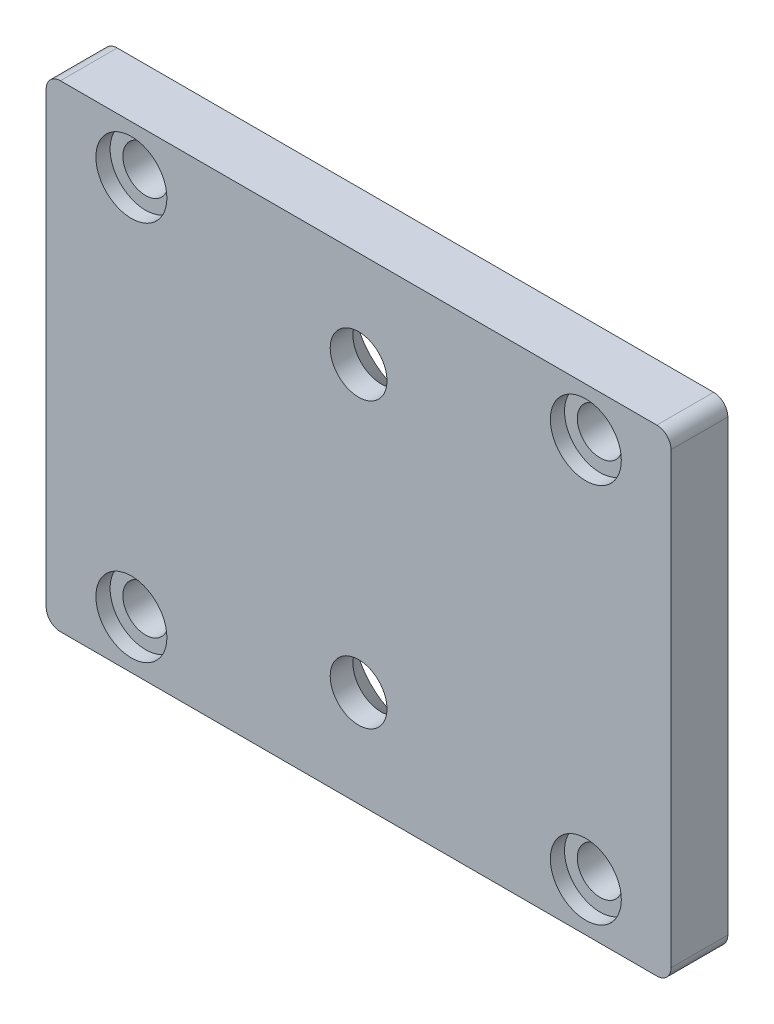
ISO-10303-21;
HEADER;
FILE_DESCRIPTION(('STEP AP214'),'2;1');
FILE_NAME('part.step','',(''),(''),'','','');
FILE_SCHEMA(('AUTOMOTIVE_DESIGN { 1 0 10303 214 1 1 1 1 }'));
ENDSEC;
DATA;
#1=APPLICATION_CONTEXT('core data for automotive mechanical design processes');
#2=APPLICATION_PROTOCOL_DEFINITION('international standard','automotive_design',2000,#1);
#3=PRODUCT_CONTEXT('',#1,'mechanical');
#4=PRODUCT('Part','Part','',(#3));
#5=PRODUCT_RELATED_PRODUCT_CATEGORY('part','',(#4));
#6=PRODUCT_DEFINITION_FORMATION('','',#4);
#7=PRODUCT_DEFINITION_CONTEXT('part definition',#1,'design');
#8=PRODUCT_DEFINITION('design','',#6,#7);
#9=PRODUCT_DEFINITION_SHAPE('','',#8);
#10=(LENGTH_UNIT() NAMED_UNIT(*) SI_UNIT(.MILLI.,.METRE.));
#11=(NAMED_UNIT(*) PLANE_ANGLE_UNIT() SI_UNIT($,.RADIAN.));
#12=(NAMED_UNIT(*) SI_UNIT($,.STERADIAN.) SOLID_ANGLE_UNIT());
#13=UNCERTAINTY_MEASURE_WITH_UNIT(LENGTH_MEASURE(1.E-05),#10,'distance_accuracy_value','');
#14=(GEOMETRIC_REPRESENTATION_CONTEXT(3) GLOBAL_UNCERTAINTY_ASSIGNED_CONTEXT((#13)) GLOBAL_UNIT_ASSIGNED_CONTEXT((#10,
#11,#12)) REPRESENTATION_CONTEXT('',''));
#15=CARTESIAN_POINT('',(0.,0.,0.));
#16=DIRECTION('',(0.,0.,1.));
#17=DIRECTION('',(1.,0.,0.));
#18=AXIS2_PLACEMENT_3D('',#15,#16,#17);
#19=CARTESIAN_POINT('',(11.,3.4,-2.));
#20=DIRECTION('',(0.,0.,-1.));
#21=DIRECTION('',(-1.,0.,0.));
#22=AXIS2_PLACEMENT_3D('',#19,#20,#21);
#23=CONICAL_SURFACE('',#22,2.2,0.785398163397449);
#24=CARTESIAN_POINT('',(11.,3.4,-2.));
#25=DIRECTION('',(0.,0.,-1.));
#26=DIRECTION('',(-1.,0.,0.));
#27=AXIS2_PLACEMENT_3D('',#24,#25,#26);
#28=CIRCLE('',#27,2.2);
#29=CARTESIAN_POINT('',(8.8,3.4,-2.));
#30=VERTEX_POINT('',#29);
#31=EDGE_CURVE('E11',#30,#30,#28,.T.);
#32=ORIENTED_EDGE('',*,*,#31,.T.);
#33=EDGE_LOOP('',(#32));
#34=FACE_BOUND('',#33,.T.);
#35=CARTESIAN_POINT('',(11.,3.4,-0.8));
#36=DIRECTION('',(0.,0.,-1.));
#37=DIRECTION('',(-1.,0.,0.));
#38=AXIS2_PLACEMENT_3D('',#35,#36,#37);
#39=CIRCLE('',#38,0.999999999999999);
#40=CARTESIAN_POINT('',(10.,3.4,-0.8));
#41=VERTEX_POINT('',#40);
#42=EDGE_CURVE('E26',#41,#41,#39,.T.);
#43=ORIENTED_EDGE('',*,*,#42,.F.);
#44=EDGE_LOOP('',(#43));
#45=FACE_BOUND('',#44,.T.);
#46=ADVANCED_FACE('F16',(#34,#45),#23,.F.);
#47=CARTESIAN_POINT('',(11.,3.4,-2.));
#48=DIRECTION('',(0.,0.,-1.));
#49=DIRECTION('',(-1.,0.,0.));
#50=AXIS2_PLACEMENT_3D('',#47,#48,#49);
#51=CYLINDRICAL_SURFACE('',#50,0.999999999999999);
#52=ORIENTED_EDGE('',*,*,#42,.T.);
#53=EDGE_LOOP('',(#52));
#54=FACE_BOUND('',#53,.T.);
#55=CARTESIAN_POINT('',(11.,3.4,0.));
#56=DIRECTION('',(0.,0.,-1.));
#57=DIRECTION('',(-1.,0.,0.));
#58=AXIS2_PLACEMENT_3D('',#55,#56,#57);
#59=CIRCLE('',#58,0.999999999999999);
#60=CARTESIAN_POINT('',(10.,3.4,0.));
#61=VERTEX_POINT('',#60);
#62=EDGE_CURVE('E106',#61,#61,#59,.T.);
#63=ORIENTED_EDGE('',*,*,#62,.F.);
#64=EDGE_LOOP('',(#63));
#65=FACE_BOUND('',#64,.T.);
#66=ADVANCED_FACE('F224',(#54,#65),#51,.F.);
#67=CARTESIAN_POINT('',(11.,13.4,-2.));
#68=DIRECTION('',(0.,0.,-1.));
#69=DIRECTION('',(-1.,0.,0.));
#70=AXIS2_PLACEMENT_3D('',#67,#68,#69);
#71=CONICAL_SURFACE('',#70,2.2,0.785398163397449);
#72=CARTESIAN_POINT('',(11.,13.4,-2.));
#73=DIRECTION('',(0.,0.,-1.));
#74=DIRECTION('',(-1.,0.,0.));
#75=AXIS2_PLACEMENT_3D('',#72,#73,#74);
#76=CIRCLE('',#75,2.2);
#77=CARTESIAN_POINT('',(8.8,13.4,-2.));
#78=VERTEX_POINT('',#77);
#79=EDGE_CURVE('E216',#78,#78,#76,.T.);
#80=ORIENTED_EDGE('',*,*,#79,.T.);
#81=EDGE_LOOP('',(#80));
#82=FACE_BOUND('',#81,.T.);
#83=CARTESIAN_POINT('',(11.,13.4,-0.8));
#84=DIRECTION('',(0.,0.,-1.));
#85=DIRECTION('',(-1.,0.,0.));
#86=AXIS2_PLACEMENT_3D('',#83,#84,#85);
#87=CIRCLE('',#86,0.999999999999999);
#88=CARTESIAN_POINT('',(10.,13.4,-0.8));
#89=VERTEX_POINT('',#88);
#90=EDGE_CURVE('E211',#89,#89,#87,.T.);
#91=ORIENTED_EDGE('',*,*,#90,.F.);
#92=EDGE_LOOP('',(#91));
#93=FACE_BOUND('',#92,.T.);
#94=ADVANCED_FACE('F234',(#82,#93),#71,.F.);
#95=CARTESIAN_POINT('',(11.,13.4,-2.));
#96=DIRECTION('',(0.,0.,-1.));
#97=DIRECTION('',(-1.,0.,0.));
#98=AXIS2_PLACEMENT_3D('',#95,#96,#97);
#99=CYLINDRICAL_SURFACE('',#98,0.999999999999999);
#100=ORIENTED_EDGE('',*,*,#90,.T.);
#101=EDGE_LOOP('',(#100));
#102=FACE_BOUND('',#101,.T.);
#103=CARTESIAN_POINT('',(11.,13.4,0.));
#104=DIRECTION('',(0.,0.,-1.));
#105=DIRECTION('',(-1.,0.,0.));
#106=AXIS2_PLACEMENT_3D('',#103,#104,#105);
#107=CIRCLE('',#106,0.999999999999999);
#108=CARTESIAN_POINT('',(10.,13.4,0.));
#109=VERTEX_POINT('',#108);
#110=EDGE_CURVE('E111',#109,#109,#107,.T.);
#111=ORIENTED_EDGE('',*,*,#110,.F.);
#112=EDGE_LOOP('',(#111));
#113=FACE_BOUND('',#112,.T.);
#114=ADVANCED_FACE('F239',(#102,#113),#99,.F.);
#115=CARTESIAN_POINT('',(3.,15.1,0.));
#116=DIRECTION('',(0.,0.,1.));
#117=DIRECTION('',(1.,0.,0.));
#118=AXIS2_PLACEMENT_3D('',#115,#116,#117);
#119=CYLINDRICAL_SURFACE('',#118,1.25);
#120=CARTESIAN_POINT('',(3.,15.1,0.));
#121=DIRECTION('',(0.,0.,1.));
#122=DIRECTION('',(1.,0.,0.));
#123=AXIS2_PLACEMENT_3D('',#120,#121,#122);
#124=CIRCLE('',#123,1.25);
#125=CARTESIAN_POINT('',(4.25,15.1,0.));
#126=VERTEX_POINT('',#125);
#127=EDGE_CURVE('E206',#126,#126,#124,.T.);
#128=ORIENTED_EDGE('',*,*,#127,.T.);
#129=EDGE_LOOP('',(#128));
#130=FACE_BOUND('',#129,.T.);
#131=CARTESIAN_POINT('',(3.,15.1,-0.5));
#132=DIRECTION('',(0.,0.,1.));
#133=DIRECTION('',(1.,0.,0.));
#134=AXIS2_PLACEMENT_3D('',#131,#132,#133);
#135=CIRCLE('',#134,1.25);
#136=CARTESIAN_POINT('',(4.25,15.1,-0.5));
#137=VERTEX_POINT('',#136);
#138=EDGE_CURVE('E203',#137,#137,#135,.T.);
#139=ORIENTED_EDGE('',*,*,#138,.F.);
#140=EDGE_LOOP('',(#139));
#141=FACE_BOUND('',#140,.T.);
#142=ADVANCED_FACE('F243',(#130,#141),#119,.F.);
#143=CARTESIAN_POINT('',(3.,15.1,0.));
#144=DIRECTION('',(0.,0.,1.));
#145=DIRECTION('',(1.,0.,0.));
#146=AXIS2_PLACEMENT_3D('',#143,#144,#145);
#147=CYLINDRICAL_SURFACE('',#146,0.8);
#148=CARTESIAN_POINT('',(3.,15.1,-0.5));
#149=DIRECTION('',(0.,0.,1.));
#150=DIRECTION('',(1.,0.,0.));
#151=AXIS2_PLACEMENT_3D('',#148,#149,#150);
#152=CIRCLE('',#151,0.8);
#153=CARTESIAN_POINT('',(3.8,15.1,-0.5));
#154=VERTEX_POINT('',#153);
#155=EDGE_CURVE('E200',#154,#154,#152,.T.);
#156=ORIENTED_EDGE('',*,*,#155,.T.);
#157=EDGE_LOOP('',(#156));
#158=FACE_BOUND('',#157,.T.);
#159=CARTESIAN_POINT('',(3.,15.1,-2.));
#160=DIRECTION('',(0.,0.,1.));
#161=DIRECTION('',(1.,0.,0.));
#162=AXIS2_PLACEMENT_3D('',#159,#160,#161);
#163=CIRCLE('',#162,0.8);
#164=CARTESIAN_POINT('',(3.8,15.1,-2.));
#165=VERTEX_POINT('',#164);
#166=EDGE_CURVE('E94',#165,#165,#163,.T.);
#167=ORIENTED_EDGE('',*,*,#166,.F.);
#168=EDGE_LOOP('',(#167));
#169=FACE_BOUND('',#168,.T.);
#170=ADVANCED_FACE('F247',(#158,#169),#147,.F.);
#171=CARTESIAN_POINT('',(19.,15.1,0.));
#172=DIRECTION('',(0.,0.,1.));
#173=DIRECTION('',(1.,0.,0.));
#174=AXIS2_PLACEMENT_3D('',#171,#172,#173);
#175=CYLINDRICAL_SURFACE('',#174,1.25);
#176=CARTESIAN_POINT('',(19.,15.1,0.));
#177=DIRECTION('',(0.,0.,1.));
#178=DIRECTION('',(1.,0.,0.));
#179=AXIS2_PLACEMENT_3D('',#176,#177,#178);
#180=CIRCLE('',#179,1.25);
#181=CARTESIAN_POINT('',(20.25,15.1,0.));
#182=VERTEX_POINT('',#181);
#183=EDGE_CURVE('E195',#182,#182,#180,.T.);
#184=ORIENTED_EDGE('',*,*,#183,.T.);
#185=EDGE_LOOP('',(#184));
#186=FACE_BOUND('',#185,.T.);
#187=CARTESIAN_POINT('',(19.,15.1,-0.5));
#188=DIRECTION('',(0.,0.,1.));
#189=DIRECTION('',(1.,0.,0.));
#190=AXIS2_PLACEMENT_3D('',#187,#188,#189);
#191=CIRCLE('',#190,1.25);
#192=CARTESIAN_POINT('',(20.25,15.1,-0.5));
#193=VERTEX_POINT('',#192);
#194=EDGE_CURVE('E192',#193,#193,#191,.T.);
#195=ORIENTED_EDGE('',*,*,#194,.F.);
#196=EDGE_LOOP('',(#195));
#197=FACE_BOUND('',#196,.T.);
#198=ADVANCED_FACE('F251',(#186,#197),#175,.F.);
#199=CARTESIAN_POINT('',(19.,15.1,0.));
#200=DIRECTION('',(0.,0.,1.));
#201=DIRECTION('',(1.,0.,0.));
#202=AXIS2_PLACEMENT_3D('',#199,#200,#201);
#203=CYLINDRICAL_SURFACE('',#202,0.799999999999999);
#204=CARTESIAN_POINT('',(19.,15.1,-0.5));
#205=DIRECTION('',(0.,0.,1.));
#206=DIRECTION('',(1.,0.,0.));
#207=AXIS2_PLACEMENT_3D('',#204,#205,#206);
#208=CIRCLE('',#207,0.800000000000002);
#209=CARTESIAN_POINT('',(19.8,15.1,-0.5));
#210=VERTEX_POINT('',#209);
#211=EDGE_CURVE('E189',#210,#210,#208,.T.);
#212=ORIENTED_EDGE('',*,*,#211,.T.);
#213=EDGE_LOOP('',(#212));
#214=FACE_BOUND('',#213,.T.);
#215=CARTESIAN_POINT('',(19.,15.1,-2.));
#216=DIRECTION('',(0.,0.,1.));
#217=DIRECTION('',(1.,0.,0.));
#218=AXIS2_PLACEMENT_3D('',#215,#216,#217);
#219=CIRCLE('',#218,0.799999999999999);
#220=CARTESIAN_POINT('',(19.8,15.1,-2.));
#221=VERTEX_POINT('',#220);
#222=EDGE_CURVE('E186',#221,#221,#219,.T.);
#223=ORIENTED_EDGE('',*,*,#222,.F.);
#224=EDGE_LOOP('',(#223));
#225=FACE_BOUND('',#224,.T.);
#226=ADVANCED_FACE('F255',(#214,#225),#203,.F.);
#227=CARTESIAN_POINT('',(19.,1.7,0.));
#228=DIRECTION('',(0.,0.,1.));
#229=DIRECTION('',(1.,0.,0.));
#230=AXIS2_PLACEMENT_3D('',#227,#228,#229);
#231=CYLINDRICAL_SURFACE('',#230,1.25);
#232=CARTESIAN_POINT('',(19.,1.7,0.));
#233=DIRECTION('',(0.,0.,1.));
#234=DIRECTION('',(1.,0.,0.));
#235=AXIS2_PLACEMENT_3D('',#232,#233,#234);
#236=CIRCLE('',#235,1.25);
#237=CARTESIAN_POINT('',(20.25,1.7,0.));
#238=VERTEX_POINT('',#237);
#239=EDGE_CURVE('E183',#238,#238,#236,.T.);
#240=ORIENTED_EDGE('',*,*,#239,.T.);
#241=EDGE_LOOP('',(#240));
#242=FACE_BOUND('',#241,.T.);
#243=CARTESIAN_POINT('',(19.,1.7,-0.5));
#244=DIRECTION('',(0.,0.,1.));
#245=DIRECTION('',(1.,0.,0.));
#246=AXIS2_PLACEMENT_3D('',#243,#244,#245);
#247=CIRCLE('',#246,1.25);
#248=CARTESIAN_POINT('',(20.25,1.7,-0.5));
#249=VERTEX_POINT('',#248);
#250=EDGE_CURVE('E180',#249,#249,#247,.T.);
#251=ORIENTED_EDGE('',*,*,#250,.F.);
#252=EDGE_LOOP('',(#251));
#253=FACE_BOUND('',#252,.T.);
#254=ADVANCED_FACE('F259',(#242,#253),#231,.F.);
#255=CARTESIAN_POINT('',(19.,1.7,0.));
#256=DIRECTION('',(0.,0.,1.));
#257=DIRECTION('',(1.,0.,0.));
#258=AXIS2_PLACEMENT_3D('',#255,#256,#257);
#259=CYLINDRICAL_SURFACE('',#258,0.799999999999999);
#260=CARTESIAN_POINT('',(19.,1.7,-0.5));
#261=DIRECTION('',(0.,0.,1.));
#262=DIRECTION('',(1.,0.,0.));
#263=AXIS2_PLACEMENT_3D('',#260,#261,#262);
#264=CIRCLE('',#263,0.800000000000002);
#265=CARTESIAN_POINT('',(19.8,1.7,-0.5));
#266=VERTEX_POINT('',#265);
#267=EDGE_CURVE('E177',#266,#266,#264,.T.);
#268=ORIENTED_EDGE('',*,*,#267,.T.);
#269=EDGE_LOOP('',(#268));
#270=FACE_BOUND('',#269,.T.);
#271=CARTESIAN_POINT('',(19.,1.7,-2.));
#272=DIRECTION('',(0.,0.,1.));
#273=DIRECTION('',(1.,0.,0.));
#274=AXIS2_PLACEMENT_3D('',#271,#272,#273);
#275=CIRCLE('',#274,0.799999999999999);
#276=CARTESIAN_POINT('',(19.8,1.7,-2.));
#277=VERTEX_POINT('',#276);
#278=EDGE_CURVE('E174',#277,#277,#275,.T.);
#279=ORIENTED_EDGE('',*,*,#278,.F.);
#280=EDGE_LOOP('',(#279));
#281=FACE_BOUND('',#280,.T.);
#282=ADVANCED_FACE('F263',(#270,#281),#259,.F.);
#283=CARTESIAN_POINT('',(3.,1.7,0.));
#284=DIRECTION('',(0.,0.,1.));
#285=DIRECTION('',(1.,0.,0.));
#286=AXIS2_PLACEMENT_3D('',#283,#284,#285);
#287=CYLINDRICAL_SURFACE('',#286,1.25);
#288=CARTESIAN_POINT('',(3.,1.7,0.));
#289=DIRECTION('',(0.,0.,1.));
#290=DIRECTION('',(1.,0.,0.));
#291=AXIS2_PLACEMENT_3D('',#288,#289,#290);
#292=CIRCLE('',#291,1.25);
#293=CARTESIAN_POINT('',(4.25,1.7,0.));
#294=VERTEX_POINT('',#293);
#295=EDGE_CURVE('E171',#294,#294,#292,.T.);
#296=ORIENTED_EDGE('',*,*,#295,.T.);
#297=EDGE_LOOP('',(#296));
#298=FACE_BOUND('',#297,.T.);
#299=CARTESIAN_POINT('',(3.,1.7,-0.5));
#300=DIRECTION('',(0.,0.,1.));
#301=DIRECTION('',(1.,0.,0.));
#302=AXIS2_PLACEMENT_3D('',#299,#300,#301);
#303=CIRCLE('',#302,1.25);
#304=CARTESIAN_POINT('',(4.25,1.7,-0.5));
#305=VERTEX_POINT('',#304);
#306=EDGE_CURVE('E130',#305,#305,#303,.T.);
#307=ORIENTED_EDGE('',*,*,#306,.F.);
#308=EDGE_LOOP('',(#307));
#309=FACE_BOUND('',#308,.T.);
#310=ADVANCED_FACE('F267',(#298,#309),#287,.F.);
#311=CARTESIAN_POINT('',(3.,1.7,0.));
#312=DIRECTION('',(0.,0.,1.));
#313=DIRECTION('',(1.,0.,0.));
#314=AXIS2_PLACEMENT_3D('',#311,#312,#313);
#315=CYLINDRICAL_SURFACE('',#314,0.8);
#316=CARTESIAN_POINT('',(3.,1.7,-0.5));
#317=DIRECTION('',(0.,0.,1.));
#318=DIRECTION('',(1.,0.,0.));
#319=AXIS2_PLACEMENT_3D('',#316,#317,#318);
#320=CIRCLE('',#319,0.8);
#321=CARTESIAN_POINT('',(3.8,1.7,-0.5));
#322=VERTEX_POINT('',#321);
#323=EDGE_CURVE('E168',#322,#322,#320,.T.);
#324=ORIENTED_EDGE('',*,*,#323,.T.);
#325=EDGE_LOOP('',(#324));
#326=FACE_BOUND('',#325,.T.);
#327=CARTESIAN_POINT('',(3.,1.7,-2.));
#328=DIRECTION('',(0.,0.,1.));
#329=DIRECTION('',(1.,0.,0.));
#330=AXIS2_PLACEMENT_3D('',#327,#328,#329);
#331=CIRCLE('',#330,0.8);
#332=CARTESIAN_POINT('',(3.8,1.7,-2.));
#333=VERTEX_POINT('',#332);
#334=EDGE_CURVE('E146',#333,#333,#331,.T.);
#335=ORIENTED_EDGE('',*,*,#334,.F.);
#336=EDGE_LOOP('',(#335));
#337=FACE_BOUND('',#336,.T.);
#338=ADVANCED_FACE('F271',(#326,#337),#315,.F.);
#339=CARTESIAN_POINT('',(0.,0.,-2.));
#340=DIRECTION('',(-1.,0.,0.));
#341=DIRECTION('',(0.,0.,1.));
#342=AXIS2_PLACEMENT_3D('',#339,#340,#341);
#343=PLANE('',#342);
#344=DIRECTION('',(0.,-1.,0.));
#345=VECTOR('',#344,1.);
#346=CARTESIAN_POINT('',(0.,0.,-2.));
#347=LINE('',#346,#345);
#348=CARTESIAN_POINT('',(0.,16.3,-2.));
#349=VERTEX_POINT('',#348);
#350=CARTESIAN_POINT('',(0.,0.5,-2.));
#351=VERTEX_POINT('',#350);
#352=EDGE_CURVE('E154',#349,#351,#347,.T.);
#353=ORIENTED_EDGE('',*,*,#352,.T.);
#354=DIRECTION('',(0.,0.,1.));
#355=VECTOR('',#354,1.);
#356=CARTESIAN_POINT('',(0.,0.5,-2.));
#357=LINE('',#356,#355);
#358=CARTESIAN_POINT('',(0.,0.5,0.));
#359=VERTEX_POINT('',#358);
#360=EDGE_CURVE('E35',#351,#359,#357,.T.);
#361=ORIENTED_EDGE('',*,*,#360,.T.);
#362=DIRECTION('',(0.,-1.,0.));
#363=VECTOR('',#362,1.);
#364=CARTESIAN_POINT('',(0.,0.,0.));
#365=LINE('',#364,#363);
#366=CARTESIAN_POINT('',(0.,16.3,0.));
#367=VERTEX_POINT('',#366);
#368=EDGE_CURVE('E118',#367,#359,#365,.T.);
#369=ORIENTED_EDGE('',*,*,#368,.F.);
#370=DIRECTION('',(0.,0.,-1.));
#371=VECTOR('',#370,1.);
#372=CARTESIAN_POINT('',(0.,16.3,-2.));
#373=LINE('',#372,#371);
#374=EDGE_CURVE('E160',#367,#349,#373,.T.);
#375=ORIENTED_EDGE('',*,*,#374,.T.);
#376=EDGE_LOOP('',(#353,#361,#369,#375));
#377=FACE_BOUND('',#376,.T.);
#378=ADVANCED_FACE('F162',(#377),#343,.T.);
#379=CARTESIAN_POINT('',(0.,16.8,-2.));
#380=DIRECTION('',(0.,1.,0.));
#381=DIRECTION('',(0.,0.,1.));
#382=AXIS2_PLACEMENT_3D('',#379,#380,#381);
#383=PLANE('',#382);
#384=DIRECTION('',(-1.,0.,0.));
#385=VECTOR('',#384,1.);
#386=CARTESIAN_POINT('',(0.,16.8,-2.));
#387=LINE('',#386,#385);
#388=CARTESIAN_POINT('',(21.5,16.8,-2.));
#389=VERTEX_POINT('',#388);
#390=CARTESIAN_POINT('',(0.5,16.8,-2.));
#391=VERTEX_POINT('',#390);
#392=EDGE_CURVE('E152',#389,#391,#387,.T.);
#393=ORIENTED_EDGE('',*,*,#392,.T.);
#394=DIRECTION('',(0.,0.,1.));
#395=VECTOR('',#394,1.);
#396=CARTESIAN_POINT('',(0.5,16.8,-2.));
#397=LINE('',#396,#395);
#398=CARTESIAN_POINT('',(0.5,16.8,0.));
#399=VERTEX_POINT('',#398);
#400=EDGE_CURVE('E133',#391,#399,#397,.T.);
#401=ORIENTED_EDGE('',*,*,#400,.T.);
#402=DIRECTION('',(-1.,0.,0.));
#403=VECTOR('',#402,1.);
#404=CARTESIAN_POINT('',(0.,16.8,0.));
#405=LINE('',#404,#403);
#406=CARTESIAN_POINT('',(21.5,16.8,0.));
#407=VERTEX_POINT('',#406);
#408=EDGE_CURVE('E123',#407,#399,#405,.T.);
#409=ORIENTED_EDGE('',*,*,#408,.F.);
#410=DIRECTION('',(0.,0.,-1.));
#411=VECTOR('',#410,1.);
#412=CARTESIAN_POINT('',(21.5,16.8,-2.));
#413=LINE('',#412,#411);
#414=EDGE_CURVE('E135',#407,#389,#413,.T.);
#415=ORIENTED_EDGE('',*,*,#414,.T.);
#416=EDGE_LOOP('',(#393,#401,#409,#415));
#417=FACE_BOUND('',#416,.T.);
#418=ADVANCED_FACE('F278',(#417),#383,.T.);
#419=CARTESIAN_POINT('',(22.,0.,-2.));
#420=DIRECTION('',(1.,0.,0.));
#421=DIRECTION('',(0.,0.,-1.));
#422=AXIS2_PLACEMENT_3D('',#419,#420,#421);
#423=PLANE('',#422);
#424=DIRECTION('',(0.,1.,0.));
#425=VECTOR('',#424,1.);
#426=CARTESIAN_POINT('',(22.,0.,0.));
#427=LINE('',#426,#425);
#428=CARTESIAN_POINT('',(22.,0.5,0.));
#429=VERTEX_POINT('',#428);
#430=CARTESIAN_POINT('',(22.,16.3,0.));
#431=VERTEX_POINT('',#430);
#432=EDGE_CURVE('E120',#429,#431,#427,.T.);
#433=ORIENTED_EDGE('',*,*,#432,.F.);
#434=DIRECTION('',(0.,0.,-1.));
#435=VECTOR('',#434,1.);
#436=CARTESIAN_POINT('',(22.,0.5,-2.));
#437=LINE('',#436,#435);
#438=CARTESIAN_POINT('',(22.,0.5,-2.));
#439=VERTEX_POINT('',#438);
#440=EDGE_CURVE('E136',#429,#439,#437,.T.);
#441=ORIENTED_EDGE('',*,*,#440,.T.);
#442=DIRECTION('',(0.,1.,0.));
#443=VECTOR('',#442,1.);
#444=CARTESIAN_POINT('',(22.,0.,-2.));
#445=LINE('',#444,#443);
#446=CARTESIAN_POINT('',(22.,16.3,-2.));
#447=VERTEX_POINT('',#446);
#448=EDGE_CURVE('E103',#439,#447,#445,.T.);
#449=ORIENTED_EDGE('',*,*,#448,.T.);
#450=DIRECTION('',(0.,0.,1.));
#451=VECTOR('',#450,1.);
#452=CARTESIAN_POINT('',(22.,16.3,-2.));
#453=LINE('',#452,#451);
#454=EDGE_CURVE('E140',#447,#431,#453,.T.);
#455=ORIENTED_EDGE('',*,*,#454,.T.);
#456=EDGE_LOOP('',(#433,#441,#449,#455));
#457=FACE_BOUND('',#456,.T.);
#458=ADVANCED_FACE('F281',(#457),#423,.T.);
#459=CARTESIAN_POINT('',(0.,0.,-2.));
#460=DIRECTION('',(0.,-1.,0.));
#461=DIRECTION('',(0.,0.,-1.));
#462=AXIS2_PLACEMENT_3D('',#459,#460,#461);
#463=PLANE('',#462);
#464=DIRECTION('',(1.,0.,0.));
#465=VECTOR('',#464,1.);
#466=CARTESIAN_POINT('',(0.,0.,0.));
#467=LINE('',#466,#465);
#468=CARTESIAN_POINT('',(0.5,0.,0.));
#469=VERTEX_POINT('',#468);
#470=CARTESIAN_POINT('',(21.5,0.,0.));
#471=VERTEX_POINT('',#470);
#472=EDGE_CURVE('E119',#469,#471,#467,.T.);
#473=ORIENTED_EDGE('',*,*,#472,.F.);
#474=DIRECTION('',(0.,0.,-1.));
#475=VECTOR('',#474,1.);
#476=CARTESIAN_POINT('',(0.5,0.,-2.));
#477=LINE('',#476,#475);
#478=CARTESIAN_POINT('',(0.5,0.,-2.));
#479=VERTEX_POINT('',#478);
#480=EDGE_CURVE('E98',#469,#479,#477,.T.);
#481=ORIENTED_EDGE('',*,*,#480,.T.);
#482=DIRECTION('',(1.,0.,0.));
#483=VECTOR('',#482,1.);
#484=CARTESIAN_POINT('',(0.,0.,-2.));
#485=LINE('',#484,#483);
#486=CARTESIAN_POINT('',(21.5,0.,-2.));
#487=VERTEX_POINT('',#486);
#488=EDGE_CURVE('E80',#479,#487,#485,.T.);
#489=ORIENTED_EDGE('',*,*,#488,.T.);
#490=DIRECTION('',(0.,0.,1.));
#491=VECTOR('',#490,1.);
#492=CARTESIAN_POINT('',(21.5,0.,-2.));
#493=LINE('',#492,#491);
#494=EDGE_CURVE('E87',#487,#471,#493,.T.);
#495=ORIENTED_EDGE('',*,*,#494,.T.);
#496=EDGE_LOOP('',(#473,#481,#489,#495));
#497=FACE_BOUND('',#496,.T.);
#498=ADVANCED_FACE('F96',(#497),#463,.T.);
#499=CARTESIAN_POINT('',(0.,0.,-2.));
#500=DIRECTION('',(0.,0.,-1.));
#501=DIRECTION('',(-1.,0.,0.));
#502=AXIS2_PLACEMENT_3D('',#499,#500,#501);
#503=PLANE('',#502);
#504=ORIENTED_EDGE('',*,*,#31,.F.);
#505=EDGE_LOOP('',(#504));
#506=FACE_BOUND('',#505,.T.);
#507=ORIENTED_EDGE('',*,*,#79,.F.);
#508=EDGE_LOOP('',(#507));
#509=FACE_BOUND('',#508,.T.);
#510=ORIENTED_EDGE('',*,*,#166,.T.);
#511=EDGE_LOOP('',(#510));
#512=FACE_BOUND('',#511,.T.);
#513=ORIENTED_EDGE('',*,*,#222,.T.);
#514=EDGE_LOOP('',(#513));
#515=FACE_BOUND('',#514,.T.);
#516=ORIENTED_EDGE('',*,*,#278,.T.);
#517=EDGE_LOOP('',(#516));
#518=FACE_BOUND('',#517,.T.);
#519=ORIENTED_EDGE('',*,*,#334,.T.);
#520=EDGE_LOOP('',(#519));
#521=FACE_BOUND('',#520,.T.);
#522=ORIENTED_EDGE('',*,*,#488,.F.);
#523=CARTESIAN_POINT('',(0.5,0.5,-2.));
#524=DIRECTION('',(0.,0.,-1.));
#525=DIRECTION('',(-1.,0.,0.));
#526=AXIS2_PLACEMENT_3D('',#523,#524,#525);
#527=CIRCLE('',#526,0.5);
#528=EDGE_CURVE('E145',#479,#351,#527,.T.);
#529=ORIENTED_EDGE('',*,*,#528,.T.);
#530=ORIENTED_EDGE('',*,*,#352,.F.);
#531=CARTESIAN_POINT('',(0.5,16.3,-2.));
#532=DIRECTION('',(0.,0.,-1.));
#533=DIRECTION('',(-1.,0.,0.));
#534=AXIS2_PLACEMENT_3D('',#531,#532,#533);
#535=CIRCLE('',#534,0.5);
#536=EDGE_CURVE('E108',#349,#391,#535,.T.);
#537=ORIENTED_EDGE('',*,*,#536,.T.);
#538=ORIENTED_EDGE('',*,*,#392,.F.);
#539=CARTESIAN_POINT('',(21.5,16.3,-2.));
#540=DIRECTION('',(0.,0.,-1.));
#541=DIRECTION('',(-1.,0.,0.));
#542=AXIS2_PLACEMENT_3D('',#539,#540,#541);
#543=CIRCLE('',#542,0.5);
#544=EDGE_CURVE('E105',#389,#447,#543,.T.);
#545=ORIENTED_EDGE('',*,*,#544,.T.);
#546=ORIENTED_EDGE('',*,*,#448,.F.);
#547=CARTESIAN_POINT('',(21.5,0.5,-2.));
#548=DIRECTION('',(0.,0.,-1.));
#549=DIRECTION('',(-1.,0.,0.));
#550=AXIS2_PLACEMENT_3D('',#547,#548,#549);
#551=CIRCLE('',#550,0.5);
#552=EDGE_CURVE('E90',#439,#487,#551,.T.);
#553=ORIENTED_EDGE('',*,*,#552,.T.);
#554=EDGE_LOOP('',(#522,#529,#530,#537,#538,#545,#546,#553));
#555=FACE_BOUND('',#554,.T.);
#556=ADVANCED_FACE('F100',(#506,#509,#512,#515,#518,#521,#555),#503,.T.);
#557=CARTESIAN_POINT('',(0.,0.,0.));
#558=DIRECTION('',(0.,0.,-1.));
#559=DIRECTION('',(-1.,0.,0.));
#560=AXIS2_PLACEMENT_3D('',#557,#558,#559);
#561=PLANE('',#560);
#562=ORIENTED_EDGE('',*,*,#62,.T.);
#563=EDGE_LOOP('',(#562));
#564=FACE_BOUND('',#563,.T.);
#565=ORIENTED_EDGE('',*,*,#110,.T.);
#566=EDGE_LOOP('',(#565));
#567=FACE_BOUND('',#566,.T.);
#568=ORIENTED_EDGE('',*,*,#127,.F.);
#569=EDGE_LOOP('',(#568));
#570=FACE_BOUND('',#569,.T.);
#571=ORIENTED_EDGE('',*,*,#183,.F.);
#572=EDGE_LOOP('',(#571));
#573=FACE_BOUND('',#572,.T.);
#574=ORIENTED_EDGE('',*,*,#239,.F.);
#575=EDGE_LOOP('',(#574));
#576=FACE_BOUND('',#575,.T.);
#577=ORIENTED_EDGE('',*,*,#295,.F.);
#578=EDGE_LOOP('',(#577));
#579=FACE_BOUND('',#578,.T.);
#580=ORIENTED_EDGE('',*,*,#368,.T.);
#581=CARTESIAN_POINT('',(0.5,0.5,0.));
#582=DIRECTION('',(0.,0.,1.));
#583=DIRECTION('',(-1.,0.,0.));
#584=AXIS2_PLACEMENT_3D('',#581,#582,#583);
#585=CIRCLE('',#584,0.5);
#586=EDGE_CURVE('E115',#359,#469,#585,.T.);
#587=ORIENTED_EDGE('',*,*,#586,.T.);
#588=ORIENTED_EDGE('',*,*,#472,.T.);
#589=CARTESIAN_POINT('',(21.5,0.5,0.));
#590=DIRECTION('',(0.,0.,1.));
#591=DIRECTION('',(-1.,0.,0.));
#592=AXIS2_PLACEMENT_3D('',#589,#590,#591);
#593=CIRCLE('',#592,0.5);
#594=EDGE_CURVE('E92',#471,#429,#593,.T.);
#595=ORIENTED_EDGE('',*,*,#594,.T.);
#596=ORIENTED_EDGE('',*,*,#432,.T.);
#597=CARTESIAN_POINT('',(21.5,16.3,0.));
#598=DIRECTION('',(0.,0.,1.));
#599=DIRECTION('',(-1.,0.,0.));
#600=AXIS2_PLACEMENT_3D('',#597,#598,#599);
#601=CIRCLE('',#600,0.5);
#602=EDGE_CURVE('E121',#431,#407,#601,.T.);
#603=ORIENTED_EDGE('',*,*,#602,.T.);
#604=ORIENTED_EDGE('',*,*,#408,.T.);
#605=CARTESIAN_POINT('',(0.5,16.3,0.));
#606=DIRECTION('',(0.,0.,1.));
#607=DIRECTION('',(-1.,0.,0.));
#608=AXIS2_PLACEMENT_3D('',#605,#606,#607);
#609=CIRCLE('',#608,0.5);
#610=EDGE_CURVE('E20',#399,#367,#609,.T.);
#611=ORIENTED_EDGE('',*,*,#610,.T.);
#612=EDGE_LOOP('',(#580,#587,#588,#595,#596,#603,#604,#611));
#613=FACE_BOUND('',#612,.T.);
#614=ADVANCED_FACE('F290',(#564,#567,#570,#573,#576,#579,#613),#561,.F.);
#615=CARTESIAN_POINT('',(0.5,0.5,-2.));
#616=DIRECTION('',(0.,0.,1.));
#617=DIRECTION('',(1.,0.,0.));
#618=AXIS2_PLACEMENT_3D('',#615,#616,#617);
#619=CYLINDRICAL_SURFACE('',#618,0.5);
#620=ORIENTED_EDGE('',*,*,#528,.F.);
#621=ORIENTED_EDGE('',*,*,#480,.F.);
#622=ORIENTED_EDGE('',*,*,#586,.F.);
#623=ORIENTED_EDGE('',*,*,#360,.F.);
#624=EDGE_LOOP('',(#620,#621,#622,#623));
#625=FACE_BOUND('',#624,.T.);
#626=ADVANCED_FACE('F294',(#625),#619,.T.);
#627=CARTESIAN_POINT('',(21.5,0.5,-2.));
#628=DIRECTION('',(0.,0.,1.));
#629=DIRECTION('',(1.,0.,0.));
#630=AXIS2_PLACEMENT_3D('',#627,#628,#629);
#631=CYLINDRICAL_SURFACE('',#630,0.5);
#632=ORIENTED_EDGE('',*,*,#552,.F.);
#633=ORIENTED_EDGE('',*,*,#440,.F.);
#634=ORIENTED_EDGE('',*,*,#594,.F.);
#635=ORIENTED_EDGE('',*,*,#494,.F.);
#636=EDGE_LOOP('',(#632,#633,#634,#635));
#637=FACE_BOUND('',#636,.T.);
#638=ADVANCED_FACE('F88',(#637),#631,.T.);
#639=CARTESIAN_POINT('',(0.5,16.3,-2.));
#640=DIRECTION('',(0.,0.,1.));
#641=DIRECTION('',(1.,0.,0.));
#642=AXIS2_PLACEMENT_3D('',#639,#640,#641);
#643=CYLINDRICAL_SURFACE('',#642,0.5);
#644=ORIENTED_EDGE('',*,*,#536,.F.);
#645=ORIENTED_EDGE('',*,*,#374,.F.);
#646=ORIENTED_EDGE('',*,*,#610,.F.);
#647=ORIENTED_EDGE('',*,*,#400,.F.);
#648=EDGE_LOOP('',(#644,#645,#646,#647));
#649=FACE_BOUND('',#648,.T.);
#650=ADVANCED_FACE('F157',(#649),#643,.T.);
#651=CARTESIAN_POINT('',(21.5,16.3,-2.));
#652=DIRECTION('',(0.,0.,1.));
#653=DIRECTION('',(1.,0.,0.));
#654=AXIS2_PLACEMENT_3D('',#651,#652,#653);
#655=CYLINDRICAL_SURFACE('',#654,0.5);
#656=ORIENTED_EDGE('',*,*,#544,.F.);
#657=ORIENTED_EDGE('',*,*,#414,.F.);
#658=ORIENTED_EDGE('',*,*,#602,.F.);
#659=ORIENTED_EDGE('',*,*,#454,.F.);
#660=EDGE_LOOP('',(#656,#657,#658,#659));
#661=FACE_BOUND('',#660,.T.);
#662=ADVANCED_FACE('F302',(#661),#655,.T.);
#663=CARTESIAN_POINT('',(3.8,1.7,-0.5));
#664=DIRECTION('',(0.,0.,-1.));
#665=DIRECTION('',(-1.,0.,0.));
#666=AXIS2_PLACEMENT_3D('',#663,#664,#665);
#667=PLANE('',#666);
#668=ORIENTED_EDGE('',*,*,#323,.F.);
#669=EDGE_LOOP('',(#668));
#670=FACE_BOUND('',#669,.T.);
#671=ORIENTED_EDGE('',*,*,#306,.T.);
#672=EDGE_LOOP('',(#671));
#673=FACE_BOUND('',#672,.T.);
#674=ADVANCED_FACE('F305',(#670,#673),#667,.F.);
#675=CARTESIAN_POINT('',(19.8,1.7,-0.5));
#676=DIRECTION('',(0.,0.,-1.));
#677=DIRECTION('',(-1.,0.,0.));
#678=AXIS2_PLACEMENT_3D('',#675,#676,#677);
#679=PLANE('',#678);
#680=ORIENTED_EDGE('',*,*,#267,.F.);
#681=EDGE_LOOP('',(#680));
#682=FACE_BOUND('',#681,.T.);
#683=ORIENTED_EDGE('',*,*,#250,.T.);
#684=EDGE_LOOP('',(#683));
#685=FACE_BOUND('',#684,.T.);
#686=ADVANCED_FACE('F309',(#682,#685),#679,.F.);
#687=CARTESIAN_POINT('',(19.8,15.1,-0.5));
#688=DIRECTION('',(0.,0.,-1.));
#689=DIRECTION('',(-1.,0.,0.));
#690=AXIS2_PLACEMENT_3D('',#687,#688,#689);
#691=PLANE('',#690);
#692=ORIENTED_EDGE('',*,*,#211,.F.);
#693=EDGE_LOOP('',(#692));
#694=FACE_BOUND('',#693,.T.);
#695=ORIENTED_EDGE('',*,*,#194,.T.);
#696=EDGE_LOOP('',(#695));
#697=FACE_BOUND('',#696,.T.);
#698=ADVANCED_FACE('F312',(#694,#697),#691,.F.);
#699=CARTESIAN_POINT('',(3.8,15.1,-0.5));
#700=DIRECTION('',(0.,0.,-1.));
#701=DIRECTION('',(-1.,0.,0.));
#702=AXIS2_PLACEMENT_3D('',#699,#700,#701);
#703=PLANE('',#702);
#704=ORIENTED_EDGE('',*,*,#155,.F.);
#705=EDGE_LOOP('',(#704));
#706=FACE_BOUND('',#705,.T.);
#707=ORIENTED_EDGE('',*,*,#138,.T.);
#708=EDGE_LOOP('',(#707));
#709=FACE_BOUND('',#708,.T.);
#710=ADVANCED_FACE('F18',(#706,#709),#703,.F.);
#711=CLOSED_SHELL('',(#46,#66,#94,#114,#142,#170,#198,#226,#254,#282,#310,#338,#378,#418,#458,
#498,#556,#614,#626,#638,#650,#662,#674,#686,#698,#710));
#712=MANIFOLD_SOLID_BREP('B1',#711);
#713=ADVANCED_BREP_SHAPE_REPRESENTATION('',(#18,#712),#14);
#714=SHAPE_DEFINITION_REPRESENTATION(#9,#713);
ENDSEC;
END-ISO-10303-21;
